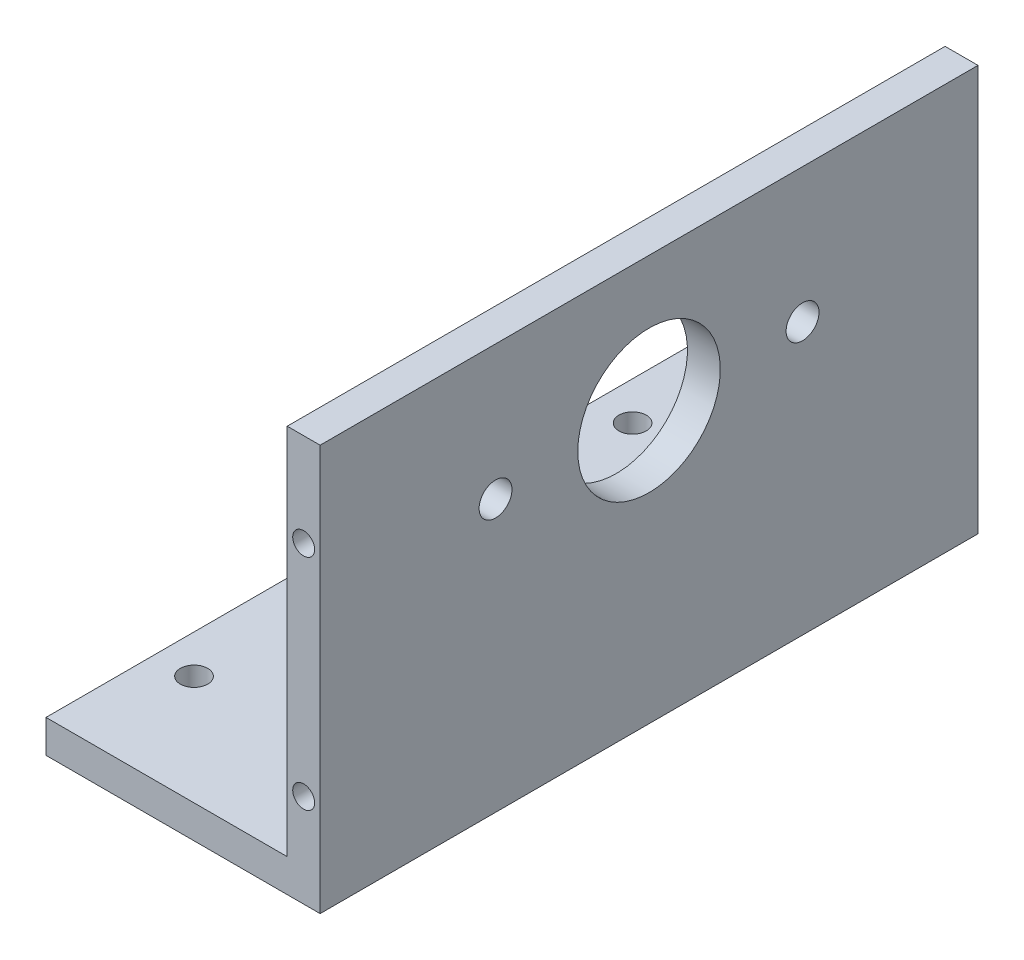
ISO-10303-21;
HEADER;
FILE_DESCRIPTION(('STEP AP214'),'2;1');
FILE_NAME('part.step','',(''),(''),'','','');
FILE_SCHEMA(('AUTOMOTIVE_DESIGN { 1 0 10303 214 1 1 1 1 }'));
ENDSEC;
DATA;
#1=APPLICATION_CONTEXT('core data for automotive mechanical design processes');
#2=APPLICATION_PROTOCOL_DEFINITION('international standard','automotive_design',2000,#1);
#3=PRODUCT_CONTEXT('',#1,'mechanical');
#4=PRODUCT('Part','Part','',(#3));
#5=PRODUCT_RELATED_PRODUCT_CATEGORY('part','',(#4));
#6=PRODUCT_DEFINITION_FORMATION('','',#4);
#7=PRODUCT_DEFINITION_CONTEXT('part definition',#1,'design');
#8=PRODUCT_DEFINITION('design','',#6,#7);
#9=PRODUCT_DEFINITION_SHAPE('','',#8);
#10=(LENGTH_UNIT() NAMED_UNIT(*) SI_UNIT(.MILLI.,.METRE.));
#11=(NAMED_UNIT(*) PLANE_ANGLE_UNIT() SI_UNIT($,.RADIAN.));
#12=(NAMED_UNIT(*) SI_UNIT($,.STERADIAN.) SOLID_ANGLE_UNIT());
#13=UNCERTAINTY_MEASURE_WITH_UNIT(LENGTH_MEASURE(1.E-05),#10,'distance_accuracy_value','');
#14=(GEOMETRIC_REPRESENTATION_CONTEXT(3) GLOBAL_UNCERTAINTY_ASSIGNED_CONTEXT((#13)) GLOBAL_UNIT_ASSIGNED_CONTEXT((#10,
#11,#12)) REPRESENTATION_CONTEXT('',''));
#15=CARTESIAN_POINT('',(0.,0.,0.));
#16=DIRECTION('',(0.,0.,1.));
#17=DIRECTION('',(1.,0.,0.));
#18=AXIS2_PLACEMENT_3D('',#15,#16,#17);
#19=CARTESIAN_POINT('',(0.,6.,60.));
#20=DIRECTION('',(0.,0.,-1.));
#21=DIRECTION('',(-1.,0.,0.));
#22=AXIS2_PLACEMENT_3D('',#19,#20,#21);
#23=PLANE('',#22);
#24=CARTESIAN_POINT('',(22.0000000000001,17.,60.));
#25=DIRECTION('',(0.,0.,-1.));
#26=DIRECTION('',(-1.,0.,0.));
#27=AXIS2_PLACEMENT_3D('',#24,#25,#26);
#28=CIRCLE('',#27,2.);
#29=CARTESIAN_POINT('',(20.0000000000001,17.,60.));
#30=VERTEX_POINT('',#29);
#31=EDGE_CURVE('E181',#30,#30,#28,.T.);
#32=ORIENTED_EDGE('',*,*,#31,.T.);
#33=EDGE_LOOP('',(#32));
#34=FACE_BOUND('',#33,.T.);
#35=DIRECTION('',(1.,0.,0.));
#36=VECTOR('',#35,1.);
#37=CARTESIAN_POINT('',(0.,0.,60.));
#38=LINE('',#37,#36);
#39=CARTESIAN_POINT('',(-25.,0.,60.));
#40=VERTEX_POINT('',#39);
#41=CARTESIAN_POINT('',(25.,0.,60.));
#42=VERTEX_POINT('',#41);
#43=EDGE_CURVE('E89',#40,#42,#38,.T.);
#44=ORIENTED_EDGE('',*,*,#43,.T.);
#45=DIRECTION('',(0.,-1.,0.));
#46=VECTOR('',#45,1.);
#47=CARTESIAN_POINT('',(25.,74.,60.));
#48=LINE('',#47,#46);
#49=CARTESIAN_POINT('',(25.,74.,60.));
#50=VERTEX_POINT('',#49);
#51=EDGE_CURVE('E109',#50,#42,#48,.T.);
#52=ORIENTED_EDGE('',*,*,#51,.F.);
#53=DIRECTION('',(1.,0.,0.));
#54=VECTOR('',#53,1.);
#55=CARTESIAN_POINT('',(0.,74.,60.));
#56=LINE('',#55,#54);
#57=CARTESIAN_POINT('',(19.,74.,60.));
#58=VERTEX_POINT('',#57);
#59=EDGE_CURVE('E131',#58,#50,#56,.T.);
#60=ORIENTED_EDGE('',*,*,#59,.F.);
#61=DIRECTION('',(0.,-1.,0.));
#62=VECTOR('',#61,1.);
#63=CARTESIAN_POINT('',(19.,74.,60.));
#64=LINE('',#63,#62);
#65=CARTESIAN_POINT('',(19.,6.00000000000001,60.));
#66=VERTEX_POINT('',#65);
#67=EDGE_CURVE('E104',#58,#66,#64,.T.);
#68=ORIENTED_EDGE('',*,*,#67,.T.);
#69=DIRECTION('',(1.,0.,0.));
#70=VECTOR('',#69,1.);
#71=CARTESIAN_POINT('',(0.,6.,60.));
#72=LINE('',#71,#70);
#73=CARTESIAN_POINT('',(-25.,6.,60.));
#74=VERTEX_POINT('',#73);
#75=EDGE_CURVE('E72',#74,#66,#72,.T.);
#76=ORIENTED_EDGE('',*,*,#75,.F.);
#77=DIRECTION('',(0.,-1.,0.));
#78=VECTOR('',#77,1.);
#79=CARTESIAN_POINT('',(-25.,6.,60.));
#80=LINE('',#79,#78);
#81=EDGE_CURVE('E49',#74,#40,#80,.T.);
#82=ORIENTED_EDGE('',*,*,#81,.T.);
#83=EDGE_LOOP('',(#44,#52,#60,#68,#76,#82));
#84=FACE_BOUND('',#83,.T.);
#85=CARTESIAN_POINT('',(22.0000000000001,57.,60.));
#86=DIRECTION('',(0.,0.,-1.));
#87=DIRECTION('',(-1.,0.,0.));
#88=AXIS2_PLACEMENT_3D('',#85,#86,#87);
#89=CIRCLE('',#88,2.);
#90=CARTESIAN_POINT('',(20.0000000000001,57.,60.));
#91=VERTEX_POINT('',#90);
#92=EDGE_CURVE('E187',#91,#91,#89,.T.);
#93=ORIENTED_EDGE('',*,*,#92,.T.);
#94=EDGE_LOOP('',(#93));
#95=FACE_BOUND('',#94,.T.);
#96=ADVANCED_FACE('F39',(#34,#84,#95),#23,.F.);
#97=CARTESIAN_POINT('',(0.,6.,-60.));
#98=DIRECTION('',(0.,0.,-1.));
#99=DIRECTION('',(-1.,0.,0.));
#100=AXIS2_PLACEMENT_3D('',#97,#98,#99);
#101=PLANE('',#100);
#102=CARTESIAN_POINT('',(22.0000000000001,57.,-60.));
#103=DIRECTION('',(0.,0.,-1.));
#104=DIRECTION('',(-1.,0.,0.));
#105=AXIS2_PLACEMENT_3D('',#102,#103,#104);
#106=CIRCLE('',#105,2.);
#107=CARTESIAN_POINT('',(20.0000000000001,57.,-60.));
#108=VERTEX_POINT('',#107);
#109=EDGE_CURVE('E175',#108,#108,#106,.T.);
#110=ORIENTED_EDGE('',*,*,#109,.F.);
#111=EDGE_LOOP('',(#110));
#112=FACE_BOUND('',#111,.T.);
#113=CARTESIAN_POINT('',(22.0000000000001,17.,-60.));
#114=DIRECTION('',(0.,0.,-1.));
#115=DIRECTION('',(-1.,0.,0.));
#116=AXIS2_PLACEMENT_3D('',#113,#114,#115);
#117=CIRCLE('',#116,2.);
#118=CARTESIAN_POINT('',(20.0000000000001,17.,-60.));
#119=VERTEX_POINT('',#118);
#120=EDGE_CURVE('E169',#119,#119,#117,.T.);
#121=ORIENTED_EDGE('',*,*,#120,.F.);
#122=EDGE_LOOP('',(#121));
#123=FACE_BOUND('',#122,.T.);
#124=DIRECTION('',(1.,0.,0.));
#125=VECTOR('',#124,1.);
#126=CARTESIAN_POINT('',(0.,0.,-60.));
#127=LINE('',#126,#125);
#128=CARTESIAN_POINT('',(-25.,0.,-60.));
#129=VERTEX_POINT('',#128);
#130=CARTESIAN_POINT('',(25.,0.,-60.));
#131=VERTEX_POINT('',#130);
#132=EDGE_CURVE('E103',#129,#131,#127,.T.);
#133=ORIENTED_EDGE('',*,*,#132,.F.);
#134=DIRECTION('',(0.,-1.,0.));
#135=VECTOR('',#134,1.);
#136=CARTESIAN_POINT('',(-25.,6.,-60.));
#137=LINE('',#136,#135);
#138=CARTESIAN_POINT('',(-25.,6.,-60.));
#139=VERTEX_POINT('',#138);
#140=EDGE_CURVE('E11',#139,#129,#137,.T.);
#141=ORIENTED_EDGE('',*,*,#140,.F.);
#142=DIRECTION('',(1.,0.,0.));
#143=VECTOR('',#142,1.);
#144=CARTESIAN_POINT('',(0.,6.,-60.));
#145=LINE('',#144,#143);
#146=CARTESIAN_POINT('',(19.,6.,-60.));
#147=VERTEX_POINT('',#146);
#148=EDGE_CURVE('E84',#139,#147,#145,.T.);
#149=ORIENTED_EDGE('',*,*,#148,.T.);
#150=DIRECTION('',(0.,-1.,0.));
#151=VECTOR('',#150,1.);
#152=CARTESIAN_POINT('',(19.,74.,-60.));
#153=LINE('',#152,#151);
#154=CARTESIAN_POINT('',(19.,74.,-60.));
#155=VERTEX_POINT('',#154);
#156=EDGE_CURVE('E95',#155,#147,#153,.T.);
#157=ORIENTED_EDGE('',*,*,#156,.F.);
#158=DIRECTION('',(1.,0.,0.));
#159=VECTOR('',#158,1.);
#160=CARTESIAN_POINT('',(0.,74.,-60.));
#161=LINE('',#160,#159);
#162=CARTESIAN_POINT('',(25.,74.,-60.));
#163=VERTEX_POINT('',#162);
#164=EDGE_CURVE('E128',#155,#163,#161,.T.);
#165=ORIENTED_EDGE('',*,*,#164,.T.);
#166=DIRECTION('',(0.,-1.,0.));
#167=VECTOR('',#166,1.);
#168=CARTESIAN_POINT('',(25.,74.,-60.));
#169=LINE('',#168,#167);
#170=EDGE_CURVE('E121',#163,#131,#169,.T.);
#171=ORIENTED_EDGE('',*,*,#170,.T.);
#172=EDGE_LOOP('',(#133,#141,#149,#157,#165,#171));
#173=FACE_BOUND('',#172,.T.);
#174=ADVANCED_FACE('F41',(#112,#123,#173),#101,.T.);
#175=CARTESIAN_POINT('',(-25.,6.,0.));
#176=DIRECTION('',(-1.,0.,0.));
#177=DIRECTION('',(0.,0.,1.));
#178=AXIS2_PLACEMENT_3D('',#175,#176,#177);
#179=PLANE('',#178);
#180=DIRECTION('',(0.,0.,-1.));
#181=VECTOR('',#180,1.);
#182=CARTESIAN_POINT('',(-25.,0.,0.));
#183=LINE('',#182,#181);
#184=EDGE_CURVE('E107',#40,#129,#183,.T.);
#185=ORIENTED_EDGE('',*,*,#184,.F.);
#186=ORIENTED_EDGE('',*,*,#81,.F.);
#187=DIRECTION('',(0.,0.,-1.));
#188=VECTOR('',#187,1.);
#189=CARTESIAN_POINT('',(-25.,6.,0.));
#190=LINE('',#189,#188);
#191=EDGE_CURVE('E97',#74,#139,#190,.T.);
#192=ORIENTED_EDGE('',*,*,#191,.T.);
#193=ORIENTED_EDGE('',*,*,#140,.T.);
#194=EDGE_LOOP('',(#185,#186,#192,#193));
#195=FACE_BOUND('',#194,.T.);
#196=ADVANCED_FACE('F210',(#195),#179,.T.);
#197=CARTESIAN_POINT('',(0.,6.,0.));
#198=DIRECTION('',(0.,1.,0.));
#199=DIRECTION('',(0.,0.,1.));
#200=AXIS2_PLACEMENT_3D('',#197,#198,#199);
#201=PLANE('',#200);
#202=CARTESIAN_POINT('',(12.,6.,40.));
#203=DIRECTION('',(0.,1.,0.));
#204=DIRECTION('',(0.,0.,1.));
#205=AXIS2_PLACEMENT_3D('',#202,#203,#204);
#206=CIRCLE('',#205,2.5);
#207=CARTESIAN_POINT('',(12.,6.,42.5));
#208=VERTEX_POINT('',#207);
#209=EDGE_CURVE('E165',#208,#208,#206,.T.);
#210=ORIENTED_EDGE('',*,*,#209,.F.);
#211=EDGE_LOOP('',(#210));
#212=FACE_BOUND('',#211,.T.);
#213=CARTESIAN_POINT('',(-18.,6.,40.));
#214=DIRECTION('',(0.,1.,0.));
#215=DIRECTION('',(0.,0.,1.));
#216=AXIS2_PLACEMENT_3D('',#213,#214,#215);
#217=CIRCLE('',#216,2.5);
#218=CARTESIAN_POINT('',(-18.,6.,42.5));
#219=VERTEX_POINT('',#218);
#220=EDGE_CURVE('E162',#219,#219,#217,.T.);
#221=ORIENTED_EDGE('',*,*,#220,.F.);
#222=EDGE_LOOP('',(#221));
#223=FACE_BOUND('',#222,.T.);
#224=CARTESIAN_POINT('',(12.,6.,-40.));
#225=DIRECTION('',(0.,1.,0.));
#226=DIRECTION('',(0.,0.,1.));
#227=AXIS2_PLACEMENT_3D('',#224,#225,#226);
#228=CIRCLE('',#227,2.5);
#229=CARTESIAN_POINT('',(12.,6.,-37.5));
#230=VERTEX_POINT('',#229);
#231=EDGE_CURVE('E158',#230,#230,#228,.T.);
#232=ORIENTED_EDGE('',*,*,#231,.F.);
#233=EDGE_LOOP('',(#232));
#234=FACE_BOUND('',#233,.T.);
#235=CARTESIAN_POINT('',(-18.,6.,-40.));
#236=DIRECTION('',(0.,1.,0.));
#237=DIRECTION('',(0.,0.,1.));
#238=AXIS2_PLACEMENT_3D('',#235,#236,#237);
#239=CIRCLE('',#238,2.5);
#240=CARTESIAN_POINT('',(-18.,6.,-37.5));
#241=VERTEX_POINT('',#240);
#242=EDGE_CURVE('E154',#241,#241,#239,.T.);
#243=ORIENTED_EDGE('',*,*,#242,.F.);
#244=EDGE_LOOP('',(#243));
#245=FACE_BOUND('',#244,.T.);
#246=DIRECTION('',(0.,0.,1.));
#247=VECTOR('',#246,1.);
#248=CARTESIAN_POINT('',(19.,6.,0.));
#249=LINE('',#248,#247);
#250=EDGE_CURVE('E81',#147,#66,#249,.T.);
#251=ORIENTED_EDGE('',*,*,#250,.F.);
#252=ORIENTED_EDGE('',*,*,#148,.F.);
#253=ORIENTED_EDGE('',*,*,#191,.F.);
#254=ORIENTED_EDGE('',*,*,#75,.T.);
#255=EDGE_LOOP('',(#251,#252,#253,#254));
#256=FACE_BOUND('',#255,.T.);
#257=ADVANCED_FACE('F83',(#212,#223,#234,#245,#256),#201,.T.);
#258=CARTESIAN_POINT('',(0.,0.,0.));
#259=DIRECTION('',(0.,1.,0.));
#260=DIRECTION('',(0.,0.,1.));
#261=AXIS2_PLACEMENT_3D('',#258,#259,#260);
#262=PLANE('',#261);
#263=CARTESIAN_POINT('',(12.,0.,40.));
#264=DIRECTION('',(0.,1.,0.));
#265=DIRECTION('',(0.,0.,1.));
#266=AXIS2_PLACEMENT_3D('',#263,#264,#265);
#267=CIRCLE('',#266,2.5);
#268=CARTESIAN_POINT('',(12.,0.,42.5));
#269=VERTEX_POINT('',#268);
#270=EDGE_CURVE('E43',#269,#269,#267,.T.);
#271=ORIENTED_EDGE('',*,*,#270,.T.);
#272=EDGE_LOOP('',(#271));
#273=FACE_BOUND('',#272,.T.);
#274=CARTESIAN_POINT('',(-18.,0.,40.));
#275=DIRECTION('',(0.,1.,0.));
#276=DIRECTION('',(0.,0.,1.));
#277=AXIS2_PLACEMENT_3D('',#274,#275,#276);
#278=CIRCLE('',#277,2.5);
#279=CARTESIAN_POINT('',(-18.,0.,42.5));
#280=VERTEX_POINT('',#279);
#281=EDGE_CURVE('E161',#280,#280,#278,.T.);
#282=ORIENTED_EDGE('',*,*,#281,.T.);
#283=EDGE_LOOP('',(#282));
#284=FACE_BOUND('',#283,.T.);
#285=CARTESIAN_POINT('',(12.,0.,-40.));
#286=DIRECTION('',(0.,1.,0.));
#287=DIRECTION('',(0.,0.,1.));
#288=AXIS2_PLACEMENT_3D('',#285,#286,#287);
#289=CIRCLE('',#288,2.5);
#290=CARTESIAN_POINT('',(12.,0.,-37.5));
#291=VERTEX_POINT('',#290);
#292=EDGE_CURVE('E157',#291,#291,#289,.T.);
#293=ORIENTED_EDGE('',*,*,#292,.T.);
#294=EDGE_LOOP('',(#293));
#295=FACE_BOUND('',#294,.T.);
#296=CARTESIAN_POINT('',(-18.,0.,-40.));
#297=DIRECTION('',(0.,1.,0.));
#298=DIRECTION('',(0.,0.,1.));
#299=AXIS2_PLACEMENT_3D('',#296,#297,#298);
#300=CIRCLE('',#299,2.5);
#301=CARTESIAN_POINT('',(-18.,0.,-37.5));
#302=VERTEX_POINT('',#301);
#303=EDGE_CURVE('E151',#302,#302,#300,.T.);
#304=ORIENTED_EDGE('',*,*,#303,.T.);
#305=EDGE_LOOP('',(#304));
#306=FACE_BOUND('',#305,.T.);
#307=ORIENTED_EDGE('',*,*,#132,.T.);
#308=DIRECTION('',(0.,0.,-1.));
#309=VECTOR('',#308,1.);
#310=CARTESIAN_POINT('',(25.,0.,0.));
#311=LINE('',#310,#309);
#312=EDGE_CURVE('E125',#42,#131,#311,.T.);
#313=ORIENTED_EDGE('',*,*,#312,.F.);
#314=ORIENTED_EDGE('',*,*,#43,.F.);
#315=ORIENTED_EDGE('',*,*,#184,.T.);
#316=EDGE_LOOP('',(#307,#313,#314,#315));
#317=FACE_BOUND('',#316,.T.);
#318=ADVANCED_FACE('F214',(#273,#284,#295,#306,#317),#262,.F.);
#319=CARTESIAN_POINT('',(19.,74.,0.));
#320=DIRECTION('',(1.,0.,0.));
#321=DIRECTION('',(0.,0.,-1.));
#322=AXIS2_PLACEMENT_3D('',#319,#320,#321);
#323=PLANE('',#322);
#324=CARTESIAN_POINT('',(19.,49.5,28.));
#325=DIRECTION('',(-1.,0.,0.));
#326=DIRECTION('',(0.,0.,-1.));
#327=AXIS2_PLACEMENT_3D('',#324,#325,#326);
#328=CIRCLE('',#327,3.);
#329=CARTESIAN_POINT('',(19.,49.5,25.));
#330=VERTEX_POINT('',#329);
#331=EDGE_CURVE('E148',#330,#330,#328,.T.);
#332=ORIENTED_EDGE('',*,*,#331,.F.);
#333=EDGE_LOOP('',(#332));
#334=FACE_BOUND('',#333,.T.);
#335=CARTESIAN_POINT('',(19.,49.5,-28.));
#336=DIRECTION('',(-1.,0.,0.));
#337=DIRECTION('',(0.,0.,1.));
#338=AXIS2_PLACEMENT_3D('',#335,#336,#337);
#339=CIRCLE('',#338,3.);
#340=CARTESIAN_POINT('',(19.,49.5,-25.));
#341=VERTEX_POINT('',#340);
#342=EDGE_CURVE('E142',#341,#341,#339,.T.);
#343=ORIENTED_EDGE('',*,*,#342,.F.);
#344=EDGE_LOOP('',(#343));
#345=FACE_BOUND('',#344,.T.);
#346=CARTESIAN_POINT('',(19.,49.5,0.));
#347=DIRECTION('',(-1.,0.,0.));
#348=DIRECTION('',(0.,0.,1.));
#349=AXIS2_PLACEMENT_3D('',#346,#347,#348);
#350=CIRCLE('',#349,13.);
#351=CARTESIAN_POINT('',(19.,49.5,13.));
#352=VERTEX_POINT('',#351);
#353=EDGE_CURVE('E136',#352,#352,#350,.T.);
#354=ORIENTED_EDGE('',*,*,#353,.F.);
#355=EDGE_LOOP('',(#354));
#356=FACE_BOUND('',#355,.T.);
#357=ORIENTED_EDGE('',*,*,#156,.T.);
#358=ORIENTED_EDGE('',*,*,#250,.T.);
#359=ORIENTED_EDGE('',*,*,#67,.F.);
#360=DIRECTION('',(0.,0.,1.));
#361=VECTOR('',#360,1.);
#362=CARTESIAN_POINT('',(19.,74.,0.));
#363=LINE('',#362,#361);
#364=EDGE_CURVE('E101',#155,#58,#363,.T.);
#365=ORIENTED_EDGE('',*,*,#364,.F.);
#366=EDGE_LOOP('',(#357,#358,#359,#365));
#367=FACE_BOUND('',#366,.T.);
#368=ADVANCED_FACE('F99',(#334,#345,#356,#367),#323,.F.);
#369=CARTESIAN_POINT('',(25.,74.,0.));
#370=DIRECTION('',(-1.,0.,0.));
#371=DIRECTION('',(0.,0.,1.));
#372=AXIS2_PLACEMENT_3D('',#369,#370,#371);
#373=PLANE('',#372);
#374=CARTESIAN_POINT('',(25.,49.5,28.));
#375=DIRECTION('',(-1.,0.,0.));
#376=DIRECTION('',(0.,0.,-1.));
#377=AXIS2_PLACEMENT_3D('',#374,#375,#376);
#378=CIRCLE('',#377,3.);
#379=CARTESIAN_POINT('',(25.,49.5,25.));
#380=VERTEX_POINT('',#379);
#381=EDGE_CURVE('E145',#380,#380,#378,.T.);
#382=ORIENTED_EDGE('',*,*,#381,.T.);
#383=EDGE_LOOP('',(#382));
#384=FACE_BOUND('',#383,.T.);
#385=CARTESIAN_POINT('',(25.,49.5,-28.));
#386=DIRECTION('',(-1.,0.,0.));
#387=DIRECTION('',(0.,0.,1.));
#388=AXIS2_PLACEMENT_3D('',#385,#386,#387);
#389=CIRCLE('',#388,3.);
#390=CARTESIAN_POINT('',(25.,49.5,-25.));
#391=VERTEX_POINT('',#390);
#392=EDGE_CURVE('E139',#391,#391,#389,.T.);
#393=ORIENTED_EDGE('',*,*,#392,.T.);
#394=EDGE_LOOP('',(#393));
#395=FACE_BOUND('',#394,.T.);
#396=CARTESIAN_POINT('',(25.,49.5,0.));
#397=DIRECTION('',(-1.,0.,0.));
#398=DIRECTION('',(0.,0.,1.));
#399=AXIS2_PLACEMENT_3D('',#396,#397,#398);
#400=CIRCLE('',#399,13.);
#401=CARTESIAN_POINT('',(25.,49.5,13.));
#402=VERTEX_POINT('',#401);
#403=EDGE_CURVE('E129',#402,#402,#400,.T.);
#404=ORIENTED_EDGE('',*,*,#403,.T.);
#405=EDGE_LOOP('',(#404));
#406=FACE_BOUND('',#405,.T.);
#407=ORIENTED_EDGE('',*,*,#312,.T.);
#408=ORIENTED_EDGE('',*,*,#170,.F.);
#409=DIRECTION('',(0.,0.,-1.));
#410=VECTOR('',#409,1.);
#411=CARTESIAN_POINT('',(25.,74.,0.));
#412=LINE('',#411,#410);
#413=EDGE_CURVE('E124',#50,#163,#412,.T.);
#414=ORIENTED_EDGE('',*,*,#413,.F.);
#415=ORIENTED_EDGE('',*,*,#51,.T.);
#416=EDGE_LOOP('',(#407,#408,#414,#415));
#417=FACE_BOUND('',#416,.T.);
#418=ADVANCED_FACE('F278',(#384,#395,#406,#417),#373,.F.);
#419=CARTESIAN_POINT('',(0.,74.,0.));
#420=DIRECTION('',(0.,1.,0.));
#421=DIRECTION('',(0.,0.,1.));
#422=AXIS2_PLACEMENT_3D('',#419,#420,#421);
#423=PLANE('',#422);
#424=ORIENTED_EDGE('',*,*,#164,.F.);
#425=ORIENTED_EDGE('',*,*,#364,.T.);
#426=ORIENTED_EDGE('',*,*,#59,.T.);
#427=ORIENTED_EDGE('',*,*,#413,.T.);
#428=EDGE_LOOP('',(#424,#425,#426,#427));
#429=FACE_BOUND('',#428,.T.);
#430=ADVANCED_FACE('F274',(#429),#423,.T.);
#431=CARTESIAN_POINT('',(25.,49.5,0.));
#432=DIRECTION('',(-1.,0.,0.));
#433=DIRECTION('',(0.,0.,1.));
#434=AXIS2_PLACEMENT_3D('',#431,#432,#433);
#435=CYLINDRICAL_SURFACE('',#434,13.);
#436=ORIENTED_EDGE('',*,*,#403,.F.);
#437=EDGE_LOOP('',(#436));
#438=FACE_BOUND('',#437,.T.);
#439=ORIENTED_EDGE('',*,*,#353,.T.);
#440=EDGE_LOOP('',(#439));
#441=FACE_BOUND('',#440,.T.);
#442=ADVANCED_FACE('F270',(#438,#441),#435,.F.);
#443=CARTESIAN_POINT('',(25.,49.5,-28.));
#444=DIRECTION('',(-1.,0.,0.));
#445=DIRECTION('',(0.,0.,1.));
#446=AXIS2_PLACEMENT_3D('',#443,#444,#445);
#447=CYLINDRICAL_SURFACE('',#446,3.);
#448=ORIENTED_EDGE('',*,*,#392,.F.);
#449=EDGE_LOOP('',(#448));
#450=FACE_BOUND('',#449,.T.);
#451=ORIENTED_EDGE('',*,*,#342,.T.);
#452=EDGE_LOOP('',(#451));
#453=FACE_BOUND('',#452,.T.);
#454=ADVANCED_FACE('F266',(#450,#453),#447,.F.);
#455=CARTESIAN_POINT('',(25.,49.5,28.));
#456=DIRECTION('',(-1.,0.,0.));
#457=DIRECTION('',(0.,0.,1.));
#458=AXIS2_PLACEMENT_3D('',#455,#456,#457);
#459=CYLINDRICAL_SURFACE('',#458,3.);
#460=ORIENTED_EDGE('',*,*,#381,.F.);
#461=EDGE_LOOP('',(#460));
#462=FACE_BOUND('',#461,.T.);
#463=ORIENTED_EDGE('',*,*,#331,.T.);
#464=EDGE_LOOP('',(#463));
#465=FACE_BOUND('',#464,.T.);
#466=ADVANCED_FACE('F262',(#462,#465),#459,.F.);
#467=CARTESIAN_POINT('',(-18.,-4.,-40.));
#468=DIRECTION('',(0.,1.,0.));
#469=DIRECTION('',(0.,0.,1.));
#470=AXIS2_PLACEMENT_3D('',#467,#468,#469);
#471=CYLINDRICAL_SURFACE('',#470,2.5);
#472=ORIENTED_EDGE('',*,*,#242,.T.);
#473=EDGE_LOOP('',(#472));
#474=FACE_BOUND('',#473,.T.);
#475=ORIENTED_EDGE('',*,*,#303,.F.);
#476=EDGE_LOOP('',(#475));
#477=FACE_BOUND('',#476,.T.);
#478=ADVANCED_FACE('F255',(#474,#477),#471,.F.);
#479=CARTESIAN_POINT('',(12.,-4.,-40.));
#480=DIRECTION('',(0.,1.,0.));
#481=DIRECTION('',(0.,0.,1.));
#482=AXIS2_PLACEMENT_3D('',#479,#480,#481);
#483=CYLINDRICAL_SURFACE('',#482,2.5);
#484=ORIENTED_EDGE('',*,*,#231,.T.);
#485=EDGE_LOOP('',(#484));
#486=FACE_BOUND('',#485,.T.);
#487=ORIENTED_EDGE('',*,*,#292,.F.);
#488=EDGE_LOOP('',(#487));
#489=FACE_BOUND('',#488,.T.);
#490=ADVANCED_FACE('F245',(#486,#489),#483,.F.);
#491=CARTESIAN_POINT('',(-18.,-4.,40.));
#492=DIRECTION('',(0.,1.,0.));
#493=DIRECTION('',(0.,0.,1.));
#494=AXIS2_PLACEMENT_3D('',#491,#492,#493);
#495=CYLINDRICAL_SURFACE('',#494,2.5);
#496=ORIENTED_EDGE('',*,*,#220,.T.);
#497=EDGE_LOOP('',(#496));
#498=FACE_BOUND('',#497,.T.);
#499=ORIENTED_EDGE('',*,*,#281,.F.);
#500=EDGE_LOOP('',(#499));
#501=FACE_BOUND('',#500,.T.);
#502=ADVANCED_FACE('F242',(#498,#501),#495,.F.);
#503=CARTESIAN_POINT('',(12.,-4.,40.));
#504=DIRECTION('',(0.,1.,0.));
#505=DIRECTION('',(0.,0.,1.));
#506=AXIS2_PLACEMENT_3D('',#503,#504,#505);
#507=CYLINDRICAL_SURFACE('',#506,2.5);
#508=ORIENTED_EDGE('',*,*,#209,.T.);
#509=EDGE_LOOP('',(#508));
#510=FACE_BOUND('',#509,.T.);
#511=ORIENTED_EDGE('',*,*,#270,.F.);
#512=EDGE_LOOP('',(#511));
#513=FACE_BOUND('',#512,.T.);
#514=ADVANCED_FACE('F244',(#510,#513),#507,.F.);
#515=CARTESIAN_POINT('',(22.0000000000001,17.,-40.));
#516=DIRECTION('',(0.,0.,-1.));
#517=DIRECTION('',(-1.,0.,0.));
#518=AXIS2_PLACEMENT_3D('',#515,#516,#517);
#519=CYLINDRICAL_SURFACE('',#518,2.);
#520=CARTESIAN_POINT('',(22.0000000000001,17.,-40.));
#521=DIRECTION('',(0.,0.,-1.));
#522=DIRECTION('',(-1.,0.,0.));
#523=AXIS2_PLACEMENT_3D('',#520,#521,#522);
#524=CIRCLE('',#523,2.);
#525=CARTESIAN_POINT('',(20.0000000000001,17.,-40.));
#526=VERTEX_POINT('',#525);
#527=EDGE_CURVE('E168',#526,#526,#524,.T.);
#528=ORIENTED_EDGE('',*,*,#527,.F.);
#529=EDGE_LOOP('',(#528));
#530=FACE_BOUND('',#529,.T.);
#531=ORIENTED_EDGE('',*,*,#120,.T.);
#532=EDGE_LOOP('',(#531));
#533=FACE_BOUND('',#532,.T.);
#534=ADVANCED_FACE('F252',(#530,#533),#519,.F.);
#535=CARTESIAN_POINT('',(22.0000000000001,17.,-40.));
#536=DIRECTION('',(0.,0.,-1.));
#537=DIRECTION('',(-1.,0.,0.));
#538=AXIS2_PLACEMENT_3D('',#535,#536,#537);
#539=PLANE('',#538);
#540=ORIENTED_EDGE('',*,*,#527,.T.);
#541=EDGE_LOOP('',(#540));
#542=FACE_BOUND('',#541,.T.);
#543=ADVANCED_FACE('F376',(#542),#539,.T.);
#544=CARTESIAN_POINT('',(22.0000000000001,57.,-40.));
#545=DIRECTION('',(0.,0.,-1.));
#546=DIRECTION('',(-1.,0.,0.));
#547=AXIS2_PLACEMENT_3D('',#544,#545,#546);
#548=CYLINDRICAL_SURFACE('',#547,2.);
#549=CARTESIAN_POINT('',(22.0000000000001,57.,-40.));
#550=DIRECTION('',(0.,0.,-1.));
#551=DIRECTION('',(-1.,0.,0.));
#552=AXIS2_PLACEMENT_3D('',#549,#550,#551);
#553=CIRCLE('',#552,2.);
#554=CARTESIAN_POINT('',(20.0000000000001,57.,-40.));
#555=VERTEX_POINT('',#554);
#556=EDGE_CURVE('E172',#555,#555,#553,.T.);
#557=ORIENTED_EDGE('',*,*,#556,.F.);
#558=EDGE_LOOP('',(#557));
#559=FACE_BOUND('',#558,.T.);
#560=ORIENTED_EDGE('',*,*,#109,.T.);
#561=EDGE_LOOP('',(#560));
#562=FACE_BOUND('',#561,.T.);
#563=ADVANCED_FACE('F385',(#559,#562),#548,.F.);
#564=CARTESIAN_POINT('',(22.0000000000001,57.,-40.));
#565=DIRECTION('',(0.,0.,-1.));
#566=DIRECTION('',(-1.,0.,0.));
#567=AXIS2_PLACEMENT_3D('',#564,#565,#566);
#568=PLANE('',#567);
#569=ORIENTED_EDGE('',*,*,#556,.T.);
#570=EDGE_LOOP('',(#569));
#571=FACE_BOUND('',#570,.T.);
#572=ADVANCED_FACE('F395',(#571),#568,.T.);
#573=CARTESIAN_POINT('',(22.0000000000001,17.,40.));
#574=DIRECTION('',(0.,0.,1.));
#575=DIRECTION('',(1.,0.,0.));
#576=AXIS2_PLACEMENT_3D('',#573,#574,#575);
#577=CYLINDRICAL_SURFACE('',#576,2.);
#578=CARTESIAN_POINT('',(22.0000000000001,17.,40.));
#579=DIRECTION('',(0.,0.,-1.));
#580=DIRECTION('',(-1.,0.,0.));
#581=AXIS2_PLACEMENT_3D('',#578,#579,#580);
#582=CIRCLE('',#581,2.);
#583=CARTESIAN_POINT('',(20.0000000000001,17.,40.));
#584=VERTEX_POINT('',#583);
#585=EDGE_CURVE('E178',#584,#584,#582,.T.);
#586=ORIENTED_EDGE('',*,*,#585,.T.);
#587=EDGE_LOOP('',(#586));
#588=FACE_BOUND('',#587,.T.);
#589=ORIENTED_EDGE('',*,*,#31,.F.);
#590=EDGE_LOOP('',(#589));
#591=FACE_BOUND('',#590,.T.);
#592=ADVANCED_FACE('F404',(#588,#591),#577,.F.);
#593=CARTESIAN_POINT('',(22.0000000000001,17.,40.));
#594=DIRECTION('',(0.,0.,1.));
#595=DIRECTION('',(-1.,0.,0.));
#596=AXIS2_PLACEMENT_3D('',#593,#594,#595);
#597=PLANE('',#596);
#598=ORIENTED_EDGE('',*,*,#585,.F.);
#599=EDGE_LOOP('',(#598));
#600=FACE_BOUND('',#599,.T.);
#601=ADVANCED_FACE('F202',(#600),#597,.T.);
#602=CARTESIAN_POINT('',(22.0000000000001,57.,40.));
#603=DIRECTION('',(0.,0.,1.));
#604=DIRECTION('',(1.,0.,0.));
#605=AXIS2_PLACEMENT_3D('',#602,#603,#604);
#606=CYLINDRICAL_SURFACE('',#605,2.);
#607=CARTESIAN_POINT('',(22.0000000000001,57.,40.));
#608=DIRECTION('',(0.,0.,-1.));
#609=DIRECTION('',(-1.,0.,0.));
#610=AXIS2_PLACEMENT_3D('',#607,#608,#609);
#611=CIRCLE('',#610,2.);
#612=CARTESIAN_POINT('',(20.0000000000001,57.,40.));
#613=VERTEX_POINT('',#612);
#614=EDGE_CURVE('E184',#613,#613,#611,.T.);
#615=ORIENTED_EDGE('',*,*,#614,.T.);
#616=EDGE_LOOP('',(#615));
#617=FACE_BOUND('',#616,.T.);
#618=ORIENTED_EDGE('',*,*,#92,.F.);
#619=EDGE_LOOP('',(#618));
#620=FACE_BOUND('',#619,.T.);
#621=ADVANCED_FACE('F193',(#617,#620),#606,.F.);
#622=CARTESIAN_POINT('',(22.0000000000001,57.,40.));
#623=DIRECTION('',(0.,0.,1.));
#624=DIRECTION('',(-1.,0.,0.));
#625=AXIS2_PLACEMENT_3D('',#622,#623,#624);
#626=PLANE('',#625);
#627=ORIENTED_EDGE('',*,*,#614,.F.);
#628=EDGE_LOOP('',(#627));
#629=FACE_BOUND('',#628,.T.);
#630=ADVANCED_FACE('F196',(#629),#626,.T.);
#631=CLOSED_SHELL('',(#96,#174,#196,#257,#318,#368,#418,#430,#442,#454,#466,#478,#490,#502,#514,
#534,#543,#563,#572,#592,#601,#621,#630));
#632=MANIFOLD_SOLID_BREP('B2',#631);
#633=ADVANCED_BREP_SHAPE_REPRESENTATION('',(#18,#632),#14);
#634=SHAPE_DEFINITION_REPRESENTATION(#9,#633);
ENDSEC;
END-ISO-10303-21;
